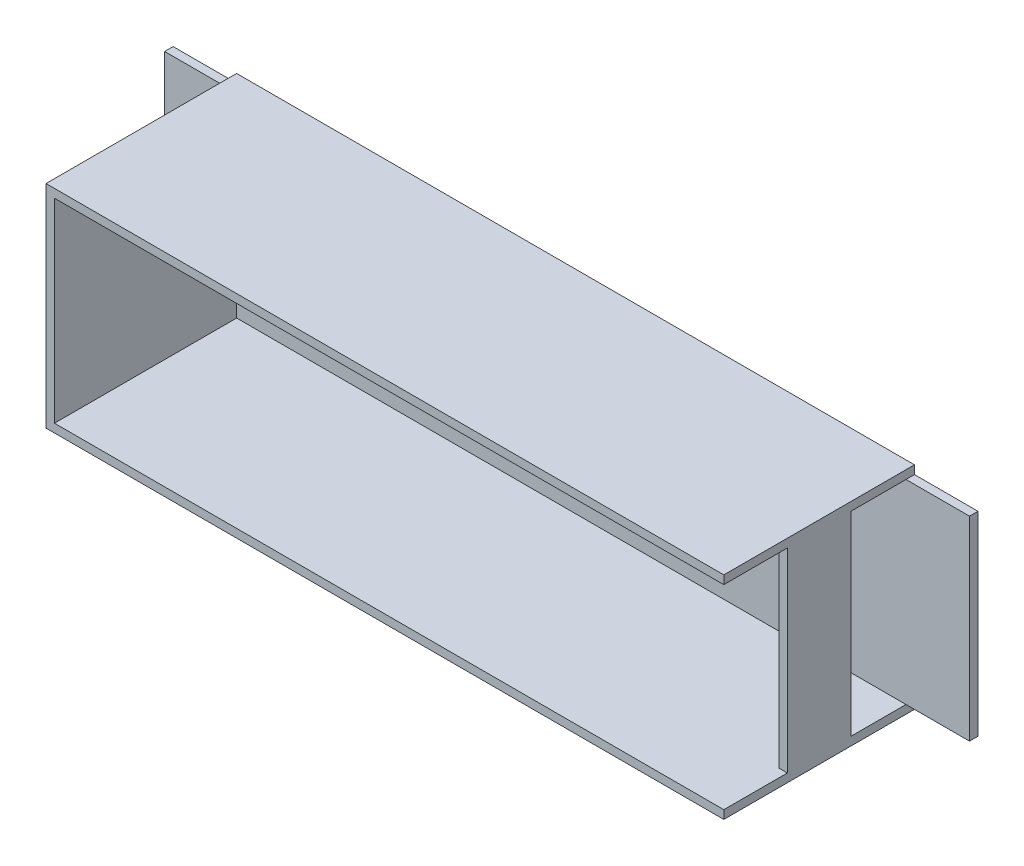
ISO-10303-21;
HEADER;
FILE_DESCRIPTION(('STEP AP214'),'2;1');
FILE_NAME('part.step','',(''),(''),'','','');
FILE_SCHEMA(('AUTOMOTIVE_DESIGN { 1 0 10303 214 1 1 1 1 }'));
ENDSEC;
DATA;
#1=APPLICATION_CONTEXT('core data for automotive mechanical design processes');
#2=APPLICATION_PROTOCOL_DEFINITION('international standard','automotive_design',2000,#1);
#3=PRODUCT_CONTEXT('',#1,'mechanical');
#4=PRODUCT('Part','Part','',(#3));
#5=PRODUCT_RELATED_PRODUCT_CATEGORY('part','',(#4));
#6=PRODUCT_DEFINITION_FORMATION('','',#4);
#7=PRODUCT_DEFINITION_CONTEXT('part definition',#1,'design');
#8=PRODUCT_DEFINITION('design','',#6,#7);
#9=PRODUCT_DEFINITION_SHAPE('','',#8);
#10=(LENGTH_UNIT() NAMED_UNIT(*) SI_UNIT(.MILLI.,.METRE.));
#11=(NAMED_UNIT(*) PLANE_ANGLE_UNIT() SI_UNIT($,.RADIAN.));
#12=(NAMED_UNIT(*) SI_UNIT($,.STERADIAN.) SOLID_ANGLE_UNIT());
#13=UNCERTAINTY_MEASURE_WITH_UNIT(LENGTH_MEASURE(1.E-05),#10,'distance_accuracy_value','');
#14=(GEOMETRIC_REPRESENTATION_CONTEXT(3) GLOBAL_UNCERTAINTY_ASSIGNED_CONTEXT((#13)) GLOBAL_UNIT_ASSIGNED_CONTEXT((#10,
#11,#12)) REPRESENTATION_CONTEXT('',''));
#15=CARTESIAN_POINT('',(0.,0.,0.));
#16=DIRECTION('',(0.,0.,1.));
#17=DIRECTION('',(1.,0.,0.));
#18=AXIS2_PLACEMENT_3D('',#15,#16,#17);
#19=CARTESIAN_POINT('',(-80.,25.,45.));
#20=DIRECTION('',(1.,0.,0.));
#21=DIRECTION('',(0.,0.,-1.));
#22=AXIS2_PLACEMENT_3D('',#19,#20,#21);
#23=PLANE('',#22);
#24=DIRECTION('',(0.,0.,-1.));
#25=VECTOR('',#24,1.);
#26=CARTESIAN_POINT('',(-80.,23.,0.));
#27=LINE('',#26,#25);
#28=CARTESIAN_POINT('',(-80.,23.,1.99999999999999));
#29=VERTEX_POINT('',#28);
#30=CARTESIAN_POINT('',(-80.,23.,0.));
#31=VERTEX_POINT('',#30);
#32=EDGE_CURVE('E55',#29,#31,#27,.T.);
#33=ORIENTED_EDGE('',*,*,#32,.F.);
#34=DIRECTION('',(0.,1.,0.));
#35=VECTOR('',#34,1.);
#36=CARTESIAN_POINT('',(-80.,23.,1.99999999999999));
#37=LINE('',#36,#35);
#38=CARTESIAN_POINT('',(-80.,-23.,2.));
#39=VERTEX_POINT('',#38);
#40=EDGE_CURVE('E375',#39,#29,#37,.T.);
#41=ORIENTED_EDGE('',*,*,#40,.F.);
#42=DIRECTION('',(0.,0.,1.));
#43=VECTOR('',#42,1.);
#44=CARTESIAN_POINT('',(-80.,-23.,2.));
#45=LINE('',#44,#43);
#46=CARTESIAN_POINT('',(-80.,-23.,0.));
#47=VERTEX_POINT('',#46);
#48=EDGE_CURVE('E61',#47,#39,#45,.T.);
#49=ORIENTED_EDGE('',*,*,#48,.F.);
#50=DIRECTION('',(0.,-1.,0.));
#51=VECTOR('',#50,1.);
#52=CARTESIAN_POINT('',(-80.,25.,0.));
#53=LINE('',#52,#51);
#54=CARTESIAN_POINT('',(-80.,-25.,0.));
#55=VERTEX_POINT('',#54);
#56=EDGE_CURVE('E195',#47,#55,#53,.T.);
#57=ORIENTED_EDGE('',*,*,#56,.T.);
#58=DIRECTION('',(0.,0.,-1.));
#59=VECTOR('',#58,1.);
#60=CARTESIAN_POINT('',(-80.,-25.,45.));
#61=LINE('',#60,#59);
#62=CARTESIAN_POINT('',(-80.,-25.,45.));
#63=VERTEX_POINT('',#62);
#64=EDGE_CURVE('E351',#63,#55,#61,.T.);
#65=ORIENTED_EDGE('',*,*,#64,.F.);
#66=DIRECTION('',(0.,-1.,0.));
#67=VECTOR('',#66,1.);
#68=CARTESIAN_POINT('',(-80.,25.,45.));
#69=LINE('',#68,#67);
#70=CARTESIAN_POINT('',(-80.,25.,45.));
#71=VERTEX_POINT('',#70);
#72=EDGE_CURVE('E329',#71,#63,#69,.T.);
#73=ORIENTED_EDGE('',*,*,#72,.F.);
#74=DIRECTION('',(0.,0.,-1.));
#75=VECTOR('',#74,1.);
#76=CARTESIAN_POINT('',(-80.,25.,45.));
#77=LINE('',#76,#75);
#78=CARTESIAN_POINT('',(-80.,25.,0.));
#79=VERTEX_POINT('',#78);
#80=EDGE_CURVE('E48',#71,#79,#77,.T.);
#81=ORIENTED_EDGE('',*,*,#80,.T.);
#82=EDGE_CURVE('E342',#79,#31,#53,.T.);
#83=ORIENTED_EDGE('',*,*,#82,.T.);
#84=EDGE_LOOP('',(#33,#41,#49,#57,#65,#73,#81,#83));
#85=FACE_BOUND('',#84,.T.);
#86=ADVANCED_FACE('F39',(#85),#23,.F.);
#87=CARTESIAN_POINT('',(80.,25.,45.));
#88=DIRECTION('',(-1.,0.,0.));
#89=DIRECTION('',(0.,0.,1.));
#90=AXIS2_PLACEMENT_3D('',#87,#88,#89);
#91=PLANE('',#90);
#92=DIRECTION('',(0.,1.,0.));
#93=VECTOR('',#92,1.);
#94=CARTESIAN_POINT('',(80.,25.,45.));
#95=LINE('',#94,#93);
#96=CARTESIAN_POINT('',(80.,23.,45.));
#97=VERTEX_POINT('',#96);
#98=CARTESIAN_POINT('',(80.,25.,45.));
#99=VERTEX_POINT('',#98);
#100=EDGE_CURVE('E326',#97,#99,#95,.T.);
#101=ORIENTED_EDGE('',*,*,#100,.F.);
#102=DIRECTION('',(0.,0.,1.));
#103=VECTOR('',#102,1.);
#104=CARTESIAN_POINT('',(80.,23.,45.));
#105=LINE('',#104,#103);
#106=CARTESIAN_POINT('',(80.,23.,30.));
#107=VERTEX_POINT('',#106);
#108=EDGE_CURVE('E221',#107,#97,#105,.T.);
#109=ORIENTED_EDGE('',*,*,#108,.F.);
#110=DIRECTION('',(0.,1.,0.));
#111=VECTOR('',#110,1.);
#112=CARTESIAN_POINT('',(80.,-23.,30.));
#113=LINE('',#112,#111);
#114=CARTESIAN_POINT('',(80.,-23.,30.));
#115=VERTEX_POINT('',#114);
#116=EDGE_CURVE('E217',#115,#107,#113,.T.);
#117=ORIENTED_EDGE('',*,*,#116,.F.);
#118=DIRECTION('',(0.,0.,-1.));
#119=VECTOR('',#118,1.);
#120=CARTESIAN_POINT('',(80.,-23.,45.));
#121=LINE('',#120,#119);
#122=CARTESIAN_POINT('',(80.,-23.,45.));
#123=VERTEX_POINT('',#122);
#124=EDGE_CURVE('E212',#123,#115,#121,.T.);
#125=ORIENTED_EDGE('',*,*,#124,.F.);
#126=CARTESIAN_POINT('',(80.,-25.,45.));
#127=VERTEX_POINT('',#126);
#128=EDGE_CURVE('E321',#127,#123,#95,.T.);
#129=ORIENTED_EDGE('',*,*,#128,.F.);
#130=DIRECTION('',(0.,0.,-1.));
#131=VECTOR('',#130,1.);
#132=CARTESIAN_POINT('',(80.,-25.,45.));
#133=LINE('',#132,#131);
#134=CARTESIAN_POINT('',(80.,-25.,0.));
#135=VERTEX_POINT('',#134);
#136=EDGE_CURVE('E335',#127,#135,#133,.T.);
#137=ORIENTED_EDGE('',*,*,#136,.T.);
#138=DIRECTION('',(0.,1.,0.));
#139=VECTOR('',#138,1.);
#140=CARTESIAN_POINT('',(80.,25.,0.));
#141=LINE('',#140,#139);
#142=CARTESIAN_POINT('',(80.,-23.,0.));
#143=VERTEX_POINT('',#142);
#144=EDGE_CURVE('E336',#135,#143,#141,.T.);
#145=ORIENTED_EDGE('',*,*,#144,.T.);
#146=DIRECTION('',(0.,0.,-1.));
#147=VECTOR('',#146,1.);
#148=CARTESIAN_POINT('',(80.,-23.,1.99999999999999));
#149=LINE('',#148,#147);
#150=CARTESIAN_POINT('',(80.,-23.,1.99999999999999));
#151=VERTEX_POINT('',#150);
#152=EDGE_CURVE('E289',#151,#143,#149,.T.);
#153=ORIENTED_EDGE('',*,*,#152,.F.);
#154=DIRECTION('',(0.,0.,-1.));
#155=VECTOR('',#154,1.);
#156=CARTESIAN_POINT('',(80.,-23.,2.));
#157=LINE('',#156,#155);
#158=CARTESIAN_POINT('',(80.,-23.,15.));
#159=VERTEX_POINT('',#158);
#160=EDGE_CURVE('E239',#159,#151,#157,.T.);
#161=ORIENTED_EDGE('',*,*,#160,.F.);
#162=DIRECTION('',(0.,-1.,0.));
#163=VECTOR('',#162,1.);
#164=CARTESIAN_POINT('',(80.,-23.,15.));
#165=LINE('',#164,#163);
#166=CARTESIAN_POINT('',(80.,23.,15.));
#167=VERTEX_POINT('',#166);
#168=EDGE_CURVE('E235',#167,#159,#165,.T.);
#169=ORIENTED_EDGE('',*,*,#168,.F.);
#170=DIRECTION('',(0.,0.,1.));
#171=VECTOR('',#170,1.);
#172=CARTESIAN_POINT('',(80.,23.,2.));
#173=LINE('',#172,#171);
#174=CARTESIAN_POINT('',(80.,23.,2.));
#175=VERTEX_POINT('',#174);
#176=EDGE_CURVE('E202',#175,#167,#173,.T.);
#177=ORIENTED_EDGE('',*,*,#176,.F.);
#178=DIRECTION('',(0.,0.,1.));
#179=VECTOR('',#178,1.);
#180=CARTESIAN_POINT('',(80.,23.,0.));
#181=LINE('',#180,#179);
#182=CARTESIAN_POINT('',(80.,23.,0.));
#183=VERTEX_POINT('',#182);
#184=EDGE_CURVE('E274',#183,#175,#181,.T.);
#185=ORIENTED_EDGE('',*,*,#184,.F.);
#186=CARTESIAN_POINT('',(80.,25.,0.));
#187=VERTEX_POINT('',#186);
#188=EDGE_CURVE('E320',#183,#187,#141,.T.);
#189=ORIENTED_EDGE('',*,*,#188,.T.);
#190=DIRECTION('',(0.,0.,-1.));
#191=VECTOR('',#190,1.);
#192=CARTESIAN_POINT('',(80.,25.,45.));
#193=LINE('',#192,#191);
#194=EDGE_CURVE('E11',#99,#187,#193,.T.);
#195=ORIENTED_EDGE('',*,*,#194,.F.);
#196=EDGE_LOOP('',(#101,#109,#117,#125,#129,#137,#145,#153,#161,#169,#177,#185,#189,#195));
#197=FACE_BOUND('',#196,.T.);
#198=ADVANCED_FACE('F41',(#197),#91,.F.);
#199=CARTESIAN_POINT('',(-80.,25.,45.));
#200=DIRECTION('',(0.,-1.,0.));
#201=DIRECTION('',(0.,0.,-1.));
#202=AXIS2_PLACEMENT_3D('',#199,#200,#201);
#203=PLANE('',#202);
#204=DIRECTION('',(-1.,0.,0.));
#205=VECTOR('',#204,1.);
#206=CARTESIAN_POINT('',(-80.,25.,0.));
#207=LINE('',#206,#205);
#208=EDGE_CURVE('E339',#187,#79,#207,.T.);
#209=ORIENTED_EDGE('',*,*,#208,.T.);
#210=ORIENTED_EDGE('',*,*,#80,.F.);
#211=DIRECTION('',(-1.,0.,0.));
#212=VECTOR('',#211,1.);
#213=CARTESIAN_POINT('',(-80.,25.,45.));
#214=LINE('',#213,#212);
#215=EDGE_CURVE('E325',#99,#71,#214,.T.);
#216=ORIENTED_EDGE('',*,*,#215,.F.);
#217=ORIENTED_EDGE('',*,*,#194,.T.);
#218=EDGE_LOOP('',(#209,#210,#216,#217));
#219=FACE_BOUND('',#218,.T.);
#220=ADVANCED_FACE('F398',(#219),#203,.F.);
#221=CARTESIAN_POINT('',(-80.,-25.,45.));
#222=DIRECTION('',(0.,1.,0.));
#223=DIRECTION('',(0.,0.,1.));
#224=AXIS2_PLACEMENT_3D('',#221,#222,#223);
#225=PLANE('',#224);
#226=DIRECTION('',(1.,0.,0.));
#227=VECTOR('',#226,1.);
#228=CARTESIAN_POINT('',(-80.,-25.,0.));
#229=LINE('',#228,#227);
#230=EDGE_CURVE('E345',#55,#135,#229,.T.);
#231=ORIENTED_EDGE('',*,*,#230,.T.);
#232=ORIENTED_EDGE('',*,*,#136,.F.);
#233=DIRECTION('',(1.,0.,0.));
#234=VECTOR('',#233,1.);
#235=CARTESIAN_POINT('',(-80.,-25.,45.));
#236=LINE('',#235,#234);
#237=EDGE_CURVE('E332',#63,#127,#236,.T.);
#238=ORIENTED_EDGE('',*,*,#237,.F.);
#239=ORIENTED_EDGE('',*,*,#64,.T.);
#240=EDGE_LOOP('',(#231,#232,#238,#239));
#241=FACE_BOUND('',#240,.T.);
#242=ADVANCED_FACE('F401',(#241),#225,.F.);
#243=CARTESIAN_POINT('',(0.,0.,45.));
#244=DIRECTION('',(0.,0.,1.));
#245=DIRECTION('',(1.,0.,0.));
#246=AXIS2_PLACEMENT_3D('',#243,#244,#245);
#247=PLANE('',#246);
#248=DIRECTION('',(-1.,0.,0.));
#249=VECTOR('',#248,1.);
#250=CARTESIAN_POINT('',(-78.,23.,45.));
#251=LINE('',#250,#249);
#252=CARTESIAN_POINT('',(-78.,23.,45.));
#253=VERTEX_POINT('',#252);
#254=EDGE_CURVE('E229',#97,#253,#251,.T.);
#255=ORIENTED_EDGE('',*,*,#254,.F.);
#256=ORIENTED_EDGE('',*,*,#100,.T.);
#257=ORIENTED_EDGE('',*,*,#215,.T.);
#258=ORIENTED_EDGE('',*,*,#72,.T.);
#259=ORIENTED_EDGE('',*,*,#237,.T.);
#260=ORIENTED_EDGE('',*,*,#128,.T.);
#261=DIRECTION('',(1.,0.,0.));
#262=VECTOR('',#261,1.);
#263=CARTESIAN_POINT('',(-78.,-23.,45.));
#264=LINE('',#263,#262);
#265=CARTESIAN_POINT('',(-78.,-23.,45.));
#266=VERTEX_POINT('',#265);
#267=EDGE_CURVE('E253',#266,#123,#264,.T.);
#268=ORIENTED_EDGE('',*,*,#267,.F.);
#269=DIRECTION('',(0.,-1.,0.));
#270=VECTOR('',#269,1.);
#271=CARTESIAN_POINT('',(-78.,23.,45.));
#272=LINE('',#271,#270);
#273=EDGE_CURVE('E264',#253,#266,#272,.T.);
#274=ORIENTED_EDGE('',*,*,#273,.F.);
#275=EDGE_LOOP('',(#255,#256,#257,#258,#259,#260,#268,#274));
#276=FACE_BOUND('',#275,.T.);
#277=ADVANCED_FACE('F407',(#276),#247,.T.);
#278=CARTESIAN_POINT('',(0.,0.,0.));
#279=DIRECTION('',(0.,0.,1.));
#280=DIRECTION('',(1.,0.,0.));
#281=AXIS2_PLACEMENT_3D('',#278,#279,#280);
#282=PLANE('',#281);
#283=ORIENTED_EDGE('',*,*,#144,.F.);
#284=ORIENTED_EDGE('',*,*,#230,.F.);
#285=ORIENTED_EDGE('',*,*,#56,.F.);
#286=DIRECTION('',(1.,0.,0.));
#287=VECTOR('',#286,1.);
#288=CARTESIAN_POINT('',(-95.,-23.,0.));
#289=LINE('',#288,#287);
#290=CARTESIAN_POINT('',(-95.,-23.,0.));
#291=VERTEX_POINT('',#290);
#292=EDGE_CURVE('E174',#291,#47,#289,.T.);
#293=ORIENTED_EDGE('',*,*,#292,.F.);
#294=DIRECTION('',(0.,-1.,0.));
#295=VECTOR('',#294,1.);
#296=CARTESIAN_POINT('',(-95.,-23.,0.));
#297=LINE('',#296,#295);
#298=CARTESIAN_POINT('',(-95.,23.,0.));
#299=VERTEX_POINT('',#298);
#300=EDGE_CURVE('E181',#299,#291,#297,.T.);
#301=ORIENTED_EDGE('',*,*,#300,.F.);
#302=DIRECTION('',(1.,0.,0.));
#303=VECTOR('',#302,1.);
#304=CARTESIAN_POINT('',(-95.,23.,0.));
#305=LINE('',#304,#303);
#306=EDGE_CURVE('E364',#299,#31,#305,.T.);
#307=ORIENTED_EDGE('',*,*,#306,.T.);
#308=ORIENTED_EDGE('',*,*,#82,.F.);
#309=ORIENTED_EDGE('',*,*,#208,.F.);
#310=ORIENTED_EDGE('',*,*,#188,.F.);
#311=DIRECTION('',(-1.,0.,0.));
#312=VECTOR('',#311,1.);
#313=CARTESIAN_POINT('',(95.,23.,0.));
#314=LINE('',#313,#312);
#315=CARTESIAN_POINT('',(95.,23.,0.));
#316=VERTEX_POINT('',#315);
#317=EDGE_CURVE('E316',#316,#183,#314,.T.);
#318=ORIENTED_EDGE('',*,*,#317,.F.);
#319=DIRECTION('',(0.,1.,0.));
#320=VECTOR('',#319,1.);
#321=CARTESIAN_POINT('',(95.,-23.,0.));
#322=LINE('',#321,#320);
#323=CARTESIAN_POINT('',(95.,-23.,0.));
#324=VERTEX_POINT('',#323);
#325=EDGE_CURVE('E284',#324,#316,#322,.T.);
#326=ORIENTED_EDGE('',*,*,#325,.F.);
#327=DIRECTION('',(-1.,0.,0.));
#328=VECTOR('',#327,1.);
#329=CARTESIAN_POINT('',(95.,-23.,0.));
#330=LINE('',#329,#328);
#331=EDGE_CURVE('E298',#324,#143,#330,.T.);
#332=ORIENTED_EDGE('',*,*,#331,.T.);
#333=EDGE_LOOP('',(#283,#284,#285,#293,#301,#307,#308,#309,#310,#318,#326,#332));
#334=FACE_BOUND('',#333,.T.);
#335=ADVANCED_FACE('F193',(#334),#282,.F.);
#336=CARTESIAN_POINT('',(95.,23.,0.));
#337=DIRECTION('',(0.,-1.,0.));
#338=DIRECTION('',(0.,0.,-1.));
#339=AXIS2_PLACEMENT_3D('',#336,#337,#338);
#340=PLANE('',#339);
#341=ORIENTED_EDGE('',*,*,#184,.T.);
#342=DIRECTION('',(-1.,0.,0.));
#343=VECTOR('',#342,1.);
#344=CARTESIAN_POINT('',(95.,23.,2.));
#345=LINE('',#344,#343);
#346=CARTESIAN_POINT('',(95.,23.,2.));
#347=VERTEX_POINT('',#346);
#348=EDGE_CURVE('E312',#347,#175,#345,.T.);
#349=ORIENTED_EDGE('',*,*,#348,.F.);
#350=DIRECTION('',(0.,0.,1.));
#351=VECTOR('',#350,1.);
#352=CARTESIAN_POINT('',(95.,23.,0.));
#353=LINE('',#352,#351);
#354=EDGE_CURVE('E288',#316,#347,#353,.T.);
#355=ORIENTED_EDGE('',*,*,#354,.F.);
#356=ORIENTED_EDGE('',*,*,#317,.T.);
#357=EDGE_LOOP('',(#341,#349,#355,#356));
#358=FACE_BOUND('',#357,.T.);
#359=ADVANCED_FACE('F449',(#358),#340,.F.);
#360=CARTESIAN_POINT('',(95.,23.,2.));
#361=DIRECTION('',(0.,0.,-1.));
#362=DIRECTION('',(0.,1.,0.));
#363=AXIS2_PLACEMENT_3D('',#360,#361,#362);
#364=PLANE('',#363);
#365=ORIENTED_EDGE('',*,*,#348,.T.);
#366=DIRECTION('',(-1.,0.,0.));
#367=VECTOR('',#366,1.);
#368=CARTESIAN_POINT('',(-78.,23.,2.));
#369=LINE('',#368,#367);
#370=CARTESIAN_POINT('',(-78.,23.,2.));
#371=VERTEX_POINT('',#370);
#372=EDGE_CURVE('E248',#175,#371,#369,.T.);
#373=ORIENTED_EDGE('',*,*,#372,.T.);
#374=DIRECTION('',(0.,-1.,0.));
#375=VECTOR('',#374,1.);
#376=CARTESIAN_POINT('',(-78.,23.,2.));
#377=LINE('',#376,#375);
#378=CARTESIAN_POINT('',(-78.,-23.,2.));
#379=VERTEX_POINT('',#378);
#380=EDGE_CURVE('E252',#371,#379,#377,.T.);
#381=ORIENTED_EDGE('',*,*,#380,.T.);
#382=DIRECTION('',(1.,0.,0.));
#383=VECTOR('',#382,1.);
#384=CARTESIAN_POINT('',(-78.,-23.,2.));
#385=LINE('',#384,#383);
#386=EDGE_CURVE('E257',#379,#151,#385,.T.);
#387=ORIENTED_EDGE('',*,*,#386,.T.);
#388=DIRECTION('',(-1.,0.,0.));
#389=VECTOR('',#388,1.);
#390=CARTESIAN_POINT('',(95.,-23.,1.99999999999999));
#391=LINE('',#390,#389);
#392=CARTESIAN_POINT('',(95.,-23.,1.99999999999999));
#393=VERTEX_POINT('',#392);
#394=EDGE_CURVE('E308',#393,#151,#391,.T.);
#395=ORIENTED_EDGE('',*,*,#394,.F.);
#396=DIRECTION('',(0.,-1.,0.));
#397=VECTOR('',#396,1.);
#398=CARTESIAN_POINT('',(95.,23.,2.));
#399=LINE('',#398,#397);
#400=EDGE_CURVE('E292',#347,#393,#399,.T.);
#401=ORIENTED_EDGE('',*,*,#400,.F.);
#402=EDGE_LOOP('',(#365,#373,#381,#387,#395,#401));
#403=FACE_BOUND('',#402,.T.);
#404=ADVANCED_FACE('F452',(#403),#364,.F.);
#405=CARTESIAN_POINT('',(95.,-23.,1.99999999999999));
#406=DIRECTION('',(0.,1.,0.));
#407=DIRECTION('',(0.,0.,1.));
#408=AXIS2_PLACEMENT_3D('',#405,#406,#407);
#409=PLANE('',#408);
#410=ORIENTED_EDGE('',*,*,#152,.T.);
#411=ORIENTED_EDGE('',*,*,#331,.F.);
#412=DIRECTION('',(0.,0.,-1.));
#413=VECTOR('',#412,1.);
#414=CARTESIAN_POINT('',(95.,-23.,1.99999999999999));
#415=LINE('',#414,#413);
#416=EDGE_CURVE('E295',#393,#324,#415,.T.);
#417=ORIENTED_EDGE('',*,*,#416,.F.);
#418=ORIENTED_EDGE('',*,*,#394,.T.);
#419=EDGE_LOOP('',(#410,#411,#417,#418));
#420=FACE_BOUND('',#419,.T.);
#421=ADVANCED_FACE('F439',(#420),#409,.F.);
#422=CARTESIAN_POINT('',(95.,0.,0.));
#423=DIRECTION('',(1.,0.,0.));
#424=DIRECTION('',(0.,0.,-1.));
#425=AXIS2_PLACEMENT_3D('',#422,#423,#424);
#426=PLANE('',#425);
#427=ORIENTED_EDGE('',*,*,#325,.T.);
#428=ORIENTED_EDGE('',*,*,#354,.T.);
#429=ORIENTED_EDGE('',*,*,#400,.T.);
#430=ORIENTED_EDGE('',*,*,#416,.T.);
#431=EDGE_LOOP('',(#427,#428,#429,#430));
#432=FACE_BOUND('',#431,.T.);
#433=ADVANCED_FACE('F454',(#432),#426,.T.);
#434=CARTESIAN_POINT('',(78.,23.,2.));
#435=DIRECTION('',(1.,0.,0.));
#436=DIRECTION('',(0.,0.,-1.));
#437=AXIS2_PLACEMENT_3D('',#434,#435,#436);
#438=PLANE('',#437);
#439=DIRECTION('',(0.,0.,1.));
#440=VECTOR('',#439,1.);
#441=CARTESIAN_POINT('',(78.,-23.,2.));
#442=LINE('',#441,#440);
#443=CARTESIAN_POINT('',(77.9999999999999,-23.,15.));
#444=VERTEX_POINT('',#443);
#445=CARTESIAN_POINT('',(78.,-23.,30.));
#446=VERTEX_POINT('',#445);
#447=EDGE_CURVE('E270',#444,#446,#442,.T.);
#448=ORIENTED_EDGE('',*,*,#447,.T.);
#449=DIRECTION('',(0.,-1.,0.));
#450=VECTOR('',#449,1.);
#451=CARTESIAN_POINT('',(78.,-23.,30.));
#452=LINE('',#451,#450);
#453=CARTESIAN_POINT('',(77.9999999999999,23.,30.));
#454=VERTEX_POINT('',#453);
#455=EDGE_CURVE('E208',#454,#446,#452,.T.);
#456=ORIENTED_EDGE('',*,*,#455,.F.);
#457=DIRECTION('',(0.,0.,1.));
#458=VECTOR('',#457,1.);
#459=CARTESIAN_POINT('',(78.,23.,2.));
#460=LINE('',#459,#458);
#461=CARTESIAN_POINT('',(78.,23.,15.));
#462=VERTEX_POINT('',#461);
#463=EDGE_CURVE('E260',#462,#454,#460,.T.);
#464=ORIENTED_EDGE('',*,*,#463,.F.);
#465=DIRECTION('',(0.,1.,0.));
#466=VECTOR('',#465,1.);
#467=CARTESIAN_POINT('',(78.,-23.,15.));
#468=LINE('',#467,#466);
#469=EDGE_CURVE('E197',#444,#462,#468,.T.);
#470=ORIENTED_EDGE('',*,*,#469,.F.);
#471=EDGE_LOOP('',(#448,#456,#464,#470));
#472=FACE_BOUND('',#471,.T.);
#473=ADVANCED_FACE('F456',(#472),#438,.F.);
#474=CARTESIAN_POINT('',(-78.,-23.,2.));
#475=DIRECTION('',(0.,-1.,0.));
#476=DIRECTION('',(0.,0.,-1.));
#477=AXIS2_PLACEMENT_3D('',#474,#475,#476);
#478=PLANE('',#477);
#479=ORIENTED_EDGE('',*,*,#267,.T.);
#480=ORIENTED_EDGE('',*,*,#124,.T.);
#481=DIRECTION('',(1.,0.,0.));
#482=VECTOR('',#481,1.);
#483=CARTESIAN_POINT('',(-80.001,-23.,30.));
#484=LINE('',#483,#482);
#485=EDGE_CURVE('E225',#446,#115,#484,.T.);
#486=ORIENTED_EDGE('',*,*,#485,.F.);
#487=ORIENTED_EDGE('',*,*,#447,.F.);
#488=DIRECTION('',(1.,0.,0.));
#489=VECTOR('',#488,1.);
#490=CARTESIAN_POINT('',(-80.001,-23.,15.));
#491=LINE('',#490,#489);
#492=EDGE_CURVE('E213',#444,#159,#491,.T.);
#493=ORIENTED_EDGE('',*,*,#492,.T.);
#494=ORIENTED_EDGE('',*,*,#160,.T.);
#495=ORIENTED_EDGE('',*,*,#386,.F.);
#496=DIRECTION('',(0.,0.,1.));
#497=VECTOR('',#496,1.);
#498=CARTESIAN_POINT('',(-78.,-23.,2.));
#499=LINE('',#498,#497);
#500=EDGE_CURVE('E275',#379,#266,#499,.T.);
#501=ORIENTED_EDGE('',*,*,#500,.T.);
#502=EDGE_LOOP('',(#479,#480,#486,#487,#493,#494,#495,#501));
#503=FACE_BOUND('',#502,.T.);
#504=ADVANCED_FACE('F430',(#503),#478,.F.);
#505=CARTESIAN_POINT('',(-78.,23.,2.));
#506=DIRECTION('',(-1.,0.,0.));
#507=DIRECTION('',(0.,0.,1.));
#508=AXIS2_PLACEMENT_3D('',#505,#506,#507);
#509=PLANE('',#508);
#510=ORIENTED_EDGE('',*,*,#273,.T.);
#511=ORIENTED_EDGE('',*,*,#500,.F.);
#512=ORIENTED_EDGE('',*,*,#380,.F.);
#513=DIRECTION('',(0.,0.,1.));
#514=VECTOR('',#513,1.);
#515=CARTESIAN_POINT('',(-78.,23.,2.));
#516=LINE('',#515,#514);
#517=EDGE_CURVE('E278',#371,#253,#516,.T.);
#518=ORIENTED_EDGE('',*,*,#517,.T.);
#519=EDGE_LOOP('',(#510,#511,#512,#518));
#520=FACE_BOUND('',#519,.T.);
#521=ADVANCED_FACE('F508',(#520),#509,.F.);
#522=CARTESIAN_POINT('',(-78.,23.,2.));
#523=DIRECTION('',(0.,1.,0.));
#524=DIRECTION('',(0.,0.,1.));
#525=AXIS2_PLACEMENT_3D('',#522,#523,#524);
#526=PLANE('',#525);
#527=ORIENTED_EDGE('',*,*,#254,.T.);
#528=ORIENTED_EDGE('',*,*,#517,.F.);
#529=ORIENTED_EDGE('',*,*,#372,.F.);
#530=ORIENTED_EDGE('',*,*,#176,.T.);
#531=DIRECTION('',(1.,0.,0.));
#532=VECTOR('',#531,1.);
#533=CARTESIAN_POINT('',(-80.001,23.,15.));
#534=LINE('',#533,#532);
#535=EDGE_CURVE('E243',#462,#167,#534,.T.);
#536=ORIENTED_EDGE('',*,*,#535,.F.);
#537=ORIENTED_EDGE('',*,*,#463,.T.);
#538=DIRECTION('',(1.,0.,0.));
#539=VECTOR('',#538,1.);
#540=CARTESIAN_POINT('',(-80.001,23.,30.));
#541=LINE('',#540,#539);
#542=EDGE_CURVE('E226',#454,#107,#541,.T.);
#543=ORIENTED_EDGE('',*,*,#542,.T.);
#544=ORIENTED_EDGE('',*,*,#108,.T.);
#545=EDGE_LOOP('',(#527,#528,#529,#530,#536,#537,#543,#544));
#546=FACE_BOUND('',#545,.T.);
#547=ADVANCED_FACE('F421',(#546),#526,.F.);
#548=CARTESIAN_POINT('',(-80.001,-23.,15.));
#549=DIRECTION('',(0.,0.,1.));
#550=DIRECTION('',(1.,0.,0.));
#551=AXIS2_PLACEMENT_3D('',#548,#549,#550);
#552=PLANE('',#551);
#553=ORIENTED_EDGE('',*,*,#469,.T.);
#554=ORIENTED_EDGE('',*,*,#535,.T.);
#555=ORIENTED_EDGE('',*,*,#168,.T.);
#556=ORIENTED_EDGE('',*,*,#492,.F.);
#557=EDGE_LOOP('',(#553,#554,#555,#556));
#558=FACE_BOUND('',#557,.T.);
#559=ADVANCED_FACE('F445',(#558),#552,.F.);
#560=CARTESIAN_POINT('',(-80.001,-23.,30.));
#561=DIRECTION('',(0.,0.,-1.));
#562=DIRECTION('',(-1.,0.,0.));
#563=AXIS2_PLACEMENT_3D('',#560,#561,#562);
#564=PLANE('',#563);
#565=ORIENTED_EDGE('',*,*,#455,.T.);
#566=ORIENTED_EDGE('',*,*,#485,.T.);
#567=ORIENTED_EDGE('',*,*,#116,.T.);
#568=ORIENTED_EDGE('',*,*,#542,.F.);
#569=EDGE_LOOP('',(#565,#566,#567,#568));
#570=FACE_BOUND('',#569,.T.);
#571=ADVANCED_FACE('F426',(#570),#564,.F.);
#572=CARTESIAN_POINT('',(-95.,-23.,2.));
#573=DIRECTION('',(0.,1.,0.));
#574=DIRECTION('',(0.,0.,1.));
#575=AXIS2_PLACEMENT_3D('',#572,#573,#574);
#576=PLANE('',#575);
#577=ORIENTED_EDGE('',*,*,#48,.T.);
#578=DIRECTION('',(1.,0.,0.));
#579=VECTOR('',#578,1.);
#580=CARTESIAN_POINT('',(-95.,-23.,2.));
#581=LINE('',#580,#579);
#582=CARTESIAN_POINT('',(-95.,-23.,2.));
#583=VERTEX_POINT('',#582);
#584=EDGE_CURVE('E176',#583,#39,#581,.T.);
#585=ORIENTED_EDGE('',*,*,#584,.F.);
#586=DIRECTION('',(0.,0.,1.));
#587=VECTOR('',#586,1.);
#588=CARTESIAN_POINT('',(-95.,-23.,2.));
#589=LINE('',#588,#587);
#590=EDGE_CURVE('E170',#291,#583,#589,.T.);
#591=ORIENTED_EDGE('',*,*,#590,.F.);
#592=ORIENTED_EDGE('',*,*,#292,.T.);
#593=EDGE_LOOP('',(#577,#585,#591,#592));
#594=FACE_BOUND('',#593,.T.);
#595=ADVANCED_FACE('F172',(#594),#576,.F.);
#596=CARTESIAN_POINT('',(-95.,23.,1.99999999999999));
#597=DIRECTION('',(0.,0.,-1.));
#598=DIRECTION('',(0.,1.,0.));
#599=AXIS2_PLACEMENT_3D('',#596,#597,#598);
#600=PLANE('',#599);
#601=ORIENTED_EDGE('',*,*,#40,.T.);
#602=DIRECTION('',(1.,0.,0.));
#603=VECTOR('',#602,1.);
#604=CARTESIAN_POINT('',(-95.,23.,1.99999999999999));
#605=LINE('',#604,#603);
#606=CARTESIAN_POINT('',(-95.,23.,1.99999999999999));
#607=VERTEX_POINT('',#606);
#608=EDGE_CURVE('E204',#607,#29,#605,.T.);
#609=ORIENTED_EDGE('',*,*,#608,.F.);
#610=DIRECTION('',(0.,1.,0.));
#611=VECTOR('',#610,1.);
#612=CARTESIAN_POINT('',(-95.,23.,1.99999999999999));
#613=LINE('',#612,#611);
#614=EDGE_CURVE('E180',#583,#607,#613,.T.);
#615=ORIENTED_EDGE('',*,*,#614,.F.);
#616=ORIENTED_EDGE('',*,*,#584,.T.);
#617=EDGE_LOOP('',(#601,#609,#615,#616));
#618=FACE_BOUND('',#617,.T.);
#619=ADVANCED_FACE('F383',(#618),#600,.F.);
#620=CARTESIAN_POINT('',(-95.,23.,0.));
#621=DIRECTION('',(0.,-1.,0.));
#622=DIRECTION('',(0.,0.,-1.));
#623=AXIS2_PLACEMENT_3D('',#620,#621,#622);
#624=PLANE('',#623);
#625=ORIENTED_EDGE('',*,*,#32,.T.);
#626=ORIENTED_EDGE('',*,*,#306,.F.);
#627=DIRECTION('',(0.,0.,-1.));
#628=VECTOR('',#627,1.);
#629=CARTESIAN_POINT('',(-95.,23.,0.));
#630=LINE('',#629,#628);
#631=EDGE_CURVE('E186',#607,#299,#630,.T.);
#632=ORIENTED_EDGE('',*,*,#631,.F.);
#633=ORIENTED_EDGE('',*,*,#608,.T.);
#634=EDGE_LOOP('',(#625,#626,#632,#633));
#635=FACE_BOUND('',#634,.T.);
#636=ADVANCED_FACE('F384',(#635),#624,.F.);
#637=CARTESIAN_POINT('',(-95.,0.,0.));
#638=DIRECTION('',(1.,0.,0.));
#639=DIRECTION('',(0.,0.,-1.));
#640=AXIS2_PLACEMENT_3D('',#637,#638,#639);
#641=PLANE('',#640);
#642=ORIENTED_EDGE('',*,*,#300,.T.);
#643=ORIENTED_EDGE('',*,*,#590,.T.);
#644=ORIENTED_EDGE('',*,*,#614,.T.);
#645=ORIENTED_EDGE('',*,*,#631,.T.);
#646=EDGE_LOOP('',(#642,#643,#644,#645));
#647=FACE_BOUND('',#646,.T.);
#648=ADVANCED_FACE('F184',(#647),#641,.F.);
#649=CLOSED_SHELL('',(#86,#198,#220,#242,#277,#335,#359,#404,#421,#433,#473,#504,#521,#547,#559,
#571,#595,#619,#636,#648));
#650=MANIFOLD_SOLID_BREP('B2',#649);
#651=ADVANCED_BREP_SHAPE_REPRESENTATION('',(#18,#650),#14);
#652=SHAPE_DEFINITION_REPRESENTATION(#9,#651);
ENDSEC;
END-ISO-10303-21;
